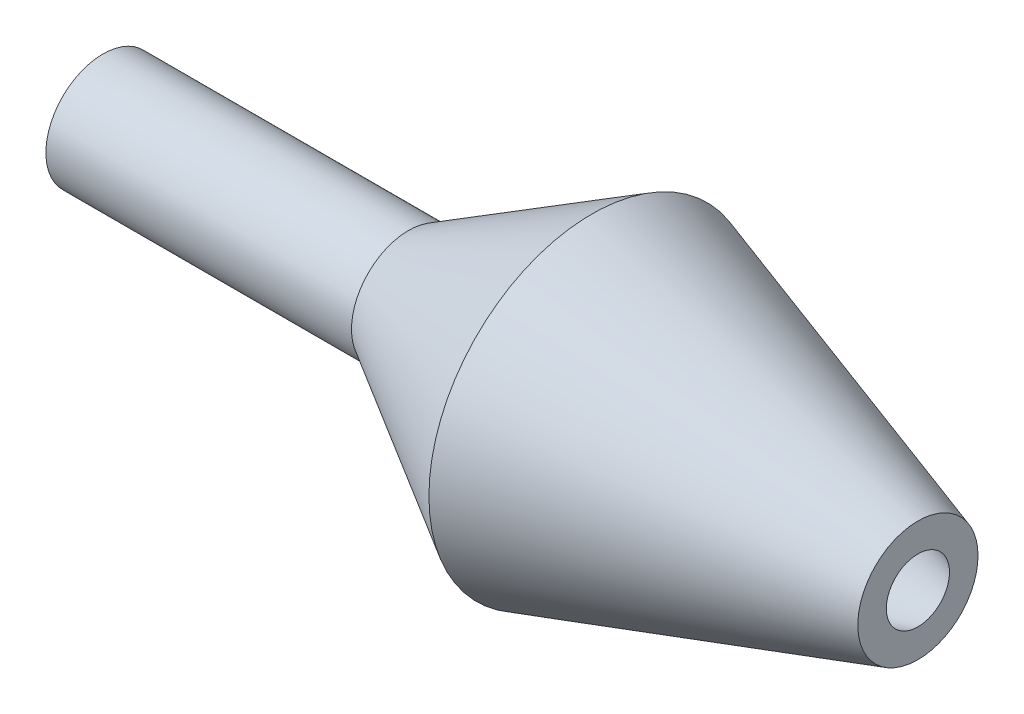
ISO-10303-21;
HEADER;
FILE_DESCRIPTION(('STEP AP214'),'2;1');
FILE_NAME('part.step','',(''),(''),'','','');
FILE_SCHEMA(('AUTOMOTIVE_DESIGN { 1 0 10303 214 1 1 1 1 }'));
ENDSEC;
DATA;
#1=APPLICATION_CONTEXT('core data for automotive mechanical design processes');
#2=APPLICATION_PROTOCOL_DEFINITION('international standard','automotive_design',2000,#1);
#3=PRODUCT_CONTEXT('',#1,'mechanical');
#4=PRODUCT('Part','Part','',(#3));
#5=PRODUCT_RELATED_PRODUCT_CATEGORY('part','',(#4));
#6=PRODUCT_DEFINITION_FORMATION('','',#4);
#7=PRODUCT_DEFINITION_CONTEXT('part definition',#1,'design');
#8=PRODUCT_DEFINITION('design','',#6,#7);
#9=PRODUCT_DEFINITION_SHAPE('','',#8);
#10=(LENGTH_UNIT() NAMED_UNIT(*) SI_UNIT(.MILLI.,.METRE.));
#11=(NAMED_UNIT(*) PLANE_ANGLE_UNIT() SI_UNIT($,.RADIAN.));
#12=(NAMED_UNIT(*) SI_UNIT($,.STERADIAN.) SOLID_ANGLE_UNIT());
#13=UNCERTAINTY_MEASURE_WITH_UNIT(LENGTH_MEASURE(1.E-05),#10,'distance_accuracy_value','');
#14=(GEOMETRIC_REPRESENTATION_CONTEXT(3) GLOBAL_UNCERTAINTY_ASSIGNED_CONTEXT((#13)) GLOBAL_UNIT_ASSIGNED_CONTEXT((#10,
#11,#12)) REPRESENTATION_CONTEXT('',''));
#15=CARTESIAN_POINT('',(0.,0.,0.));
#16=DIRECTION('',(0.,0.,1.));
#17=DIRECTION('',(1.,0.,0.));
#18=AXIS2_PLACEMENT_3D('',#15,#16,#17);
#19=CARTESIAN_POINT('',(-40.,0.,-2.8));
#20=DIRECTION('',(-1.,0.,0.));
#21=DIRECTION('',(0.,0.,1.));
#22=AXIS2_PLACEMENT_3D('',#19,#20,#21);
#23=PLANE('',#22);
#24=CARTESIAN_POINT('',(-40.,0.,0.));
#25=DIRECTION('',(1.,0.,0.));
#26=DIRECTION('',(0.,0.,-1.));
#27=AXIS2_PLACEMENT_3D('',#24,#25,#26);
#28=CIRCLE('',#27,1.4);
#29=CARTESIAN_POINT('',(-40.,0.,-1.4));
#30=VERTEX_POINT('',#29);
#31=EDGE_CURVE('E10',#30,#30,#28,.T.);
#32=ORIENTED_EDGE('',*,*,#31,.T.);
#33=EDGE_LOOP('',(#32));
#34=FACE_BOUND('',#33,.T.);
#35=CARTESIAN_POINT('',(-40.,0.,0.));
#36=DIRECTION('',(1.,0.,0.));
#37=DIRECTION('',(0.,0.,-1.));
#38=AXIS2_PLACEMENT_3D('',#35,#36,#37);
#39=CIRCLE('',#38,2.8);
#40=CARTESIAN_POINT('',(-40.,0.,-2.8));
#41=VERTEX_POINT('',#40);
#42=EDGE_CURVE('E69',#41,#41,#39,.T.);
#43=ORIENTED_EDGE('',*,*,#42,.F.);
#44=EDGE_LOOP('',(#43));
#45=FACE_BOUND('',#44,.T.);
#46=ADVANCED_FACE('F41',(#34,#45),#23,.T.);
#47=CARTESIAN_POINT('',(0.,0.,0.));
#48=DIRECTION('',(1.,0.,0.));
#49=DIRECTION('',(0.,0.,-1.));
#50=AXIS2_PLACEMENT_3D('',#47,#48,#49);
#51=CYLINDRICAL_SURFACE('',#50,1.4);
#52=CARTESIAN_POINT('',(-25.,0.,0.));
#53=DIRECTION('',(1.,0.,0.));
#54=DIRECTION('',(0.,0.,-1.));
#55=AXIS2_PLACEMENT_3D('',#52,#53,#54);
#56=CIRCLE('',#55,1.4);
#57=CARTESIAN_POINT('',(-25.,0.,-1.4));
#58=VERTEX_POINT('',#57);
#59=EDGE_CURVE('E47',#58,#58,#56,.T.);
#60=ORIENTED_EDGE('',*,*,#59,.T.);
#61=EDGE_LOOP('',(#60));
#62=FACE_BOUND('',#61,.T.);
#63=ORIENTED_EDGE('',*,*,#31,.F.);
#64=EDGE_LOOP('',(#63));
#65=FACE_BOUND('',#64,.T.);
#66=ADVANCED_FACE('F77',(#62,#65),#51,.F.);
#67=CARTESIAN_POINT('',(-25.,0.,0.));
#68=DIRECTION('',(1.,0.,0.));
#69=DIRECTION('',(0.,0.,-1.));
#70=AXIS2_PLACEMENT_3D('',#67,#68,#69);
#71=CONICAL_SURFACE('',#70,1.4,0.523919347685199);
#72=CARTESIAN_POINT('',(-16.,0.,0.));
#73=DIRECTION('',(1.,0.,0.));
#74=DIRECTION('',(0.,0.,-1.));
#75=AXIS2_PLACEMENT_3D('',#72,#73,#74);
#76=CIRCLE('',#75,6.6);
#77=CARTESIAN_POINT('',(-16.,0.,-6.6));
#78=VERTEX_POINT('',#77);
#79=EDGE_CURVE('E51',#78,#78,#76,.T.);
#80=ORIENTED_EDGE('',*,*,#79,.T.);
#81=EDGE_LOOP('',(#80));
#82=FACE_BOUND('',#81,.T.);
#83=ORIENTED_EDGE('',*,*,#59,.F.);
#84=EDGE_LOOP('',(#83));
#85=FACE_BOUND('',#84,.T.);
#86=ADVANCED_FACE('F81',(#82,#85),#71,.F.);
#87=CARTESIAN_POINT('',(-16.,0.,0.));
#88=DIRECTION('',(-1.,0.,0.));
#89=DIRECTION('',(0.,0.,1.));
#90=AXIS2_PLACEMENT_3D('',#87,#88,#89);
#91=CONICAL_SURFACE('',#90,6.6,0.305729305148115);
#92=CARTESIAN_POINT('',(0.,0.,0.));
#93=DIRECTION('',(1.,0.,0.));
#94=DIRECTION('',(0.,0.,-1.));
#95=AXIS2_PLACEMENT_3D('',#92,#93,#94);
#96=CIRCLE('',#95,1.55);
#97=CARTESIAN_POINT('',(0.,0.,-1.55));
#98=VERTEX_POINT('',#97);
#99=EDGE_CURVE('E55',#98,#98,#96,.T.);
#100=ORIENTED_EDGE('',*,*,#99,.T.);
#101=EDGE_LOOP('',(#100));
#102=FACE_BOUND('',#101,.T.);
#103=ORIENTED_EDGE('',*,*,#79,.F.);
#104=EDGE_LOOP('',(#103));
#105=FACE_BOUND('',#104,.T.);
#106=ADVANCED_FACE('F85',(#102,#105),#91,.F.);
#107=CARTESIAN_POINT('',(0.,0.,-2.95));
#108=DIRECTION('',(1.,0.,0.));
#109=DIRECTION('',(0.,0.,-1.));
#110=AXIS2_PLACEMENT_3D('',#107,#108,#109);
#111=PLANE('',#110);
#112=CARTESIAN_POINT('',(0.,0.,0.));
#113=DIRECTION('',(1.,0.,0.));
#114=DIRECTION('',(0.,0.,-1.));
#115=AXIS2_PLACEMENT_3D('',#112,#113,#114);
#116=CIRCLE('',#115,2.95);
#117=CARTESIAN_POINT('',(0.,0.,-2.95));
#118=VERTEX_POINT('',#117);
#119=EDGE_CURVE('E60',#118,#118,#116,.T.);
#120=ORIENTED_EDGE('',*,*,#119,.T.);
#121=EDGE_LOOP('',(#120));
#122=FACE_BOUND('',#121,.T.);
#123=ORIENTED_EDGE('',*,*,#99,.F.);
#124=EDGE_LOOP('',(#123));
#125=FACE_BOUND('',#124,.T.);
#126=ADVANCED_FACE('F92',(#122,#125),#111,.T.);
#127=CARTESIAN_POINT('',(0.,0.,0.));
#128=DIRECTION('',(-1.,0.,0.));
#129=DIRECTION('',(0.,0.,1.));
#130=AXIS2_PLACEMENT_3D('',#127,#128,#129);
#131=CONICAL_SURFACE('',#130,2.95,0.305729305148115);
#132=CARTESIAN_POINT('',(-16.,0.,0.));
#133=DIRECTION('',(1.,0.,0.));
#134=DIRECTION('',(0.,0.,-1.));
#135=AXIS2_PLACEMENT_3D('',#132,#133,#134);
#136=CIRCLE('',#135,8.);
#137=CARTESIAN_POINT('',(-16.,0.,-8.));
#138=VERTEX_POINT('',#137);
#139=EDGE_CURVE('E63',#138,#138,#136,.T.);
#140=ORIENTED_EDGE('',*,*,#139,.T.);
#141=EDGE_LOOP('',(#140));
#142=FACE_BOUND('',#141,.T.);
#143=ORIENTED_EDGE('',*,*,#119,.F.);
#144=EDGE_LOOP('',(#143));
#145=FACE_BOUND('',#144,.T.);
#146=ADVANCED_FACE('F96',(#142,#145),#131,.T.);
#147=CARTESIAN_POINT('',(-16.,0.,0.));
#148=DIRECTION('',(1.,0.,0.));
#149=DIRECTION('',(0.,0.,-1.));
#150=AXIS2_PLACEMENT_3D('',#147,#148,#149);
#151=CONICAL_SURFACE('',#150,8.,0.523919347685199);
#152=CARTESIAN_POINT('',(-25.,0.,0.));
#153=DIRECTION('',(1.,0.,0.));
#154=DIRECTION('',(0.,0.,-1.));
#155=AXIS2_PLACEMENT_3D('',#152,#153,#154);
#156=CIRCLE('',#155,2.8);
#157=CARTESIAN_POINT('',(-25.,0.,-2.8));
#158=VERTEX_POINT('',#157);
#159=EDGE_CURVE('E66',#158,#158,#156,.T.);
#160=ORIENTED_EDGE('',*,*,#159,.T.);
#161=EDGE_LOOP('',(#160));
#162=FACE_BOUND('',#161,.T.);
#163=ORIENTED_EDGE('',*,*,#139,.F.);
#164=EDGE_LOOP('',(#163));
#165=FACE_BOUND('',#164,.T.);
#166=ADVANCED_FACE('F100',(#162,#165),#151,.T.);
#167=CARTESIAN_POINT('',(0.,0.,0.));
#168=DIRECTION('',(1.,0.,0.));
#169=DIRECTION('',(0.,0.,-1.));
#170=AXIS2_PLACEMENT_3D('',#167,#168,#169);
#171=CYLINDRICAL_SURFACE('',#170,2.8);
#172=ORIENTED_EDGE('',*,*,#42,.T.);
#173=EDGE_LOOP('',(#172));
#174=FACE_BOUND('',#173,.T.);
#175=ORIENTED_EDGE('',*,*,#159,.F.);
#176=EDGE_LOOP('',(#175));
#177=FACE_BOUND('',#176,.T.);
#178=ADVANCED_FACE('F73',(#174,#177),#171,.T.);
#179=CLOSED_SHELL('',(#46,#66,#86,#106,#126,#146,#166,#178));
#180=MANIFOLD_SOLID_BREP('B2',#179);
#181=ADVANCED_BREP_SHAPE_REPRESENTATION('',(#18,#180),#14);
#182=SHAPE_DEFINITION_REPRESENTATION(#9,#181);
ENDSEC;
END-ISO-10303-21;
